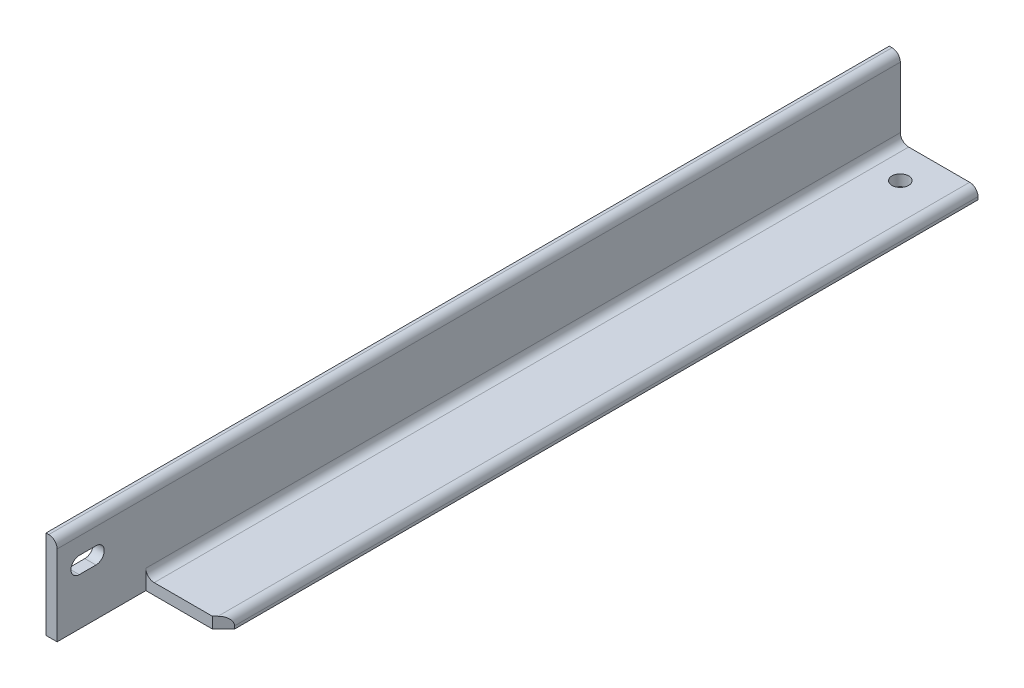
ISO-10303-21;
HEADER;
FILE_DESCRIPTION(('STEP AP214'),'2;1');
FILE_NAME('part.step','',(''),(''),'','','');
FILE_SCHEMA(('AUTOMOTIVE_DESIGN { 1 0 10303 214 1 1 1 1 }'));
ENDSEC;
DATA;
#1=APPLICATION_CONTEXT('core data for automotive mechanical design processes');
#2=APPLICATION_PROTOCOL_DEFINITION('international standard','automotive_design',2000,#1);
#3=PRODUCT_CONTEXT('',#1,'mechanical');
#4=PRODUCT('Part','Part','',(#3));
#5=PRODUCT_RELATED_PRODUCT_CATEGORY('part','',(#4));
#6=PRODUCT_DEFINITION_FORMATION('','',#4);
#7=PRODUCT_DEFINITION_CONTEXT('part definition',#1,'design');
#8=PRODUCT_DEFINITION('design','',#6,#7);
#9=PRODUCT_DEFINITION_SHAPE('','',#8);
#10=(LENGTH_UNIT() NAMED_UNIT(*) SI_UNIT(.MILLI.,.METRE.));
#11=(NAMED_UNIT(*) PLANE_ANGLE_UNIT() SI_UNIT($,.RADIAN.));
#12=(NAMED_UNIT(*) SI_UNIT($,.STERADIAN.) SOLID_ANGLE_UNIT());
#13=UNCERTAINTY_MEASURE_WITH_UNIT(LENGTH_MEASURE(1.E-05),#10,'distance_accuracy_value','');
#14=(GEOMETRIC_REPRESENTATION_CONTEXT(3) GLOBAL_UNCERTAINTY_ASSIGNED_CONTEXT((#13)) GLOBAL_UNIT_ASSIGNED_CONTEXT((#10,
#11,#12)) REPRESENTATION_CONTEXT('',''));
#15=CARTESIAN_POINT('',(0.,0.,0.));
#16=DIRECTION('',(0.,0.,1.));
#17=DIRECTION('',(1.,0.,0.));
#18=AXIS2_PLACEMENT_3D('',#15,#16,#17);
#19=CARTESIAN_POINT('',(101.6,0.,482.6));
#20=DIRECTION('',(0.,1.,0.));
#21=DIRECTION('',(-1.,0.,0.));
#22=AXIS2_PLACEMENT_3D('',#19,#20,#21);
#23=PLANE('',#22);
#24=CARTESIAN_POINT('',(50.8,0.,-444.5));
#25=DIRECTION('',(0.,-1.,0.));
#26=DIRECTION('',(0.,0.,-1.));
#27=AXIS2_PLACEMENT_3D('',#24,#25,#26);
#28=CIRCLE('',#27,9.525);
#29=CARTESIAN_POINT('',(50.8,0.,-454.025));
#30=VERTEX_POINT('',#29);
#31=EDGE_CURVE('E305',#30,#30,#28,.T.);
#32=ORIENTED_EDGE('',*,*,#31,.F.);
#33=EDGE_LOOP('',(#32));
#34=FACE_BOUND('',#33,.T.);
#35=DIRECTION('',(0.,0.,-1.));
#36=VECTOR('',#35,1.);
#37=CARTESIAN_POINT('',(101.6,0.,482.6));
#38=LINE('',#37,#36);
#39=CARTESIAN_POINT('',(101.6,0.,368.3));
#40=VERTEX_POINT('',#39);
#41=CARTESIAN_POINT('',(101.6,0.,-482.6));
#42=VERTEX_POINT('',#41);
#43=EDGE_CURVE('E11',#40,#42,#38,.T.);
#44=ORIENTED_EDGE('',*,*,#43,.F.);
#45=DIRECTION('',(0.707106781186548,0.,-0.707106781186548));
#46=VECTOR('',#45,1.);
#47=CARTESIAN_POINT('',(88.9,0.,381.));
#48=LINE('',#47,#46);
#49=CARTESIAN_POINT('',(88.9,0.,381.));
#50=VERTEX_POINT('',#49);
#51=EDGE_CURVE('E173',#50,#40,#48,.T.);
#52=ORIENTED_EDGE('',*,*,#51,.F.);
#53=DIRECTION('',(1.,0.,0.));
#54=VECTOR('',#53,1.);
#55=CARTESIAN_POINT('',(88.9,0.,381.));
#56=LINE('',#55,#54);
#57=CARTESIAN_POINT('',(12.7,0.,381.));
#58=VERTEX_POINT('',#57);
#59=EDGE_CURVE('E170',#58,#50,#56,.T.);
#60=ORIENTED_EDGE('',*,*,#59,.F.);
#61=DIRECTION('',(0.,0.,-1.));
#62=VECTOR('',#61,1.);
#63=CARTESIAN_POINT('',(12.7,0.,381.));
#64=LINE('',#63,#62);
#65=CARTESIAN_POINT('',(12.7,0.,482.6));
#66=VERTEX_POINT('',#65);
#67=EDGE_CURVE('E167',#66,#58,#64,.T.);
#68=ORIENTED_EDGE('',*,*,#67,.F.);
#69=DIRECTION('',(1.,0.,0.));
#70=VECTOR('',#69,1.);
#71=CARTESIAN_POINT('',(101.6,0.,482.6));
#72=LINE('',#71,#70);
#73=CARTESIAN_POINT('',(0.,0.,482.6));
#74=VERTEX_POINT('',#73);
#75=EDGE_CURVE('E183',#74,#66,#72,.T.);
#76=ORIENTED_EDGE('',*,*,#75,.F.);
#77=DIRECTION('',(0.,0.,-1.));
#78=VECTOR('',#77,1.);
#79=CARTESIAN_POINT('',(0.,0.,482.6));
#80=LINE('',#79,#78);
#81=CARTESIAN_POINT('',(0.,0.,-482.6));
#82=VERTEX_POINT('',#81);
#83=EDGE_CURVE('E195',#74,#82,#80,.T.);
#84=ORIENTED_EDGE('',*,*,#83,.T.);
#85=DIRECTION('',(1.,0.,0.));
#86=VECTOR('',#85,1.);
#87=CARTESIAN_POINT('',(101.6,0.,-482.6));
#88=LINE('',#87,#86);
#89=EDGE_CURVE('E179',#82,#42,#88,.T.);
#90=ORIENTED_EDGE('',*,*,#89,.T.);
#91=EDGE_LOOP('',(#44,#52,#60,#68,#76,#84,#90));
#92=FACE_BOUND('',#91,.T.);
#93=ADVANCED_FACE('F17',(#34,#92),#23,.F.);
#94=CARTESIAN_POINT('',(101.6,3.18008,482.6));
#95=DIRECTION('',(-1.,0.,0.));
#96=DIRECTION('',(0.,0.,1.));
#97=AXIS2_PLACEMENT_3D('',#94,#95,#96);
#98=PLANE('',#97);
#99=DIRECTION('',(0.,0.,-1.));
#100=VECTOR('',#99,1.);
#101=CARTESIAN_POINT('',(101.6,3.18008,482.6));
#102=LINE('',#101,#100);
#103=CARTESIAN_POINT('',(101.6,3.18008,368.3));
#104=VERTEX_POINT('',#103);
#105=CARTESIAN_POINT('',(101.6,3.18008,-482.6));
#106=VERTEX_POINT('',#105);
#107=EDGE_CURVE('E25',#104,#106,#102,.T.);
#108=ORIENTED_EDGE('',*,*,#107,.F.);
#109=DIRECTION('',(0.,-1.,0.));
#110=VECTOR('',#109,1.);
#111=CARTESIAN_POINT('',(101.6,101.601,368.3));
#112=LINE('',#111,#110);
#113=EDGE_CURVE('E176',#104,#40,#112,.T.);
#114=ORIENTED_EDGE('',*,*,#113,.T.);
#115=ORIENTED_EDGE('',*,*,#43,.T.);
#116=DIRECTION('',(0.,1.,0.));
#117=VECTOR('',#116,1.);
#118=CARTESIAN_POINT('',(101.6,3.18008,-482.6));
#119=LINE('',#118,#117);
#120=EDGE_CURVE('E198',#42,#106,#119,.T.);
#121=ORIENTED_EDGE('',*,*,#120,.T.);
#122=EDGE_LOOP('',(#108,#114,#115,#121));
#123=FACE_BOUND('',#122,.T.);
#124=ADVANCED_FACE('F243',(#123),#98,.F.);
#125=CARTESIAN_POINT('',(92.08008,3.18008,482.6));
#126=DIRECTION('',(0.,0.,-1.));
#127=DIRECTION('',(-1.,0.,0.));
#128=AXIS2_PLACEMENT_3D('',#125,#126,#127);
#129=CYLINDRICAL_SURFACE('',#128,9.51992);
#130=DIRECTION('',(0.,0.,-1.));
#131=VECTOR('',#130,1.);
#132=CARTESIAN_POINT('',(92.08008,12.7,482.6));
#133=LINE('',#132,#131);
#134=CARTESIAN_POINT('',(92.08008,12.7,377.81992));
#135=VERTEX_POINT('',#134);
#136=CARTESIAN_POINT('',(92.08008,12.7,-482.6));
#137=VERTEX_POINT('',#136);
#138=EDGE_CURVE('E232',#135,#137,#133,.T.);
#139=ORIENTED_EDGE('',*,*,#138,.F.);
#140=CARTESIAN_POINT('',(92.08008,3.18008,377.81992));
#141=DIRECTION('',(-0.707106781186548,0.,-0.707106781186548));
#142=DIRECTION('',(0.707106781186548,0.,-0.707106781186548));
#143=AXIS2_PLACEMENT_3D('',#140,#141,#142);
#144=ELLIPSE('',#143,13.4631999767069,9.51992);
#145=EDGE_CURVE('E137',#104,#135,#144,.F.);
#146=ORIENTED_EDGE('',*,*,#145,.F.);
#147=ORIENTED_EDGE('',*,*,#107,.T.);
#148=CARTESIAN_POINT('',(92.08008,3.18008,-482.6));
#149=DIRECTION('',(0.,0.,1.));
#150=DIRECTION('',(1.,0.,0.));
#151=AXIS2_PLACEMENT_3D('',#148,#149,#150);
#152=CIRCLE('',#151,9.51992);
#153=EDGE_CURVE('E201',#106,#137,#152,.T.);
#154=ORIENTED_EDGE('',*,*,#153,.T.);
#155=EDGE_LOOP('',(#139,#146,#147,#154));
#156=FACE_BOUND('',#155,.T.);
#157=ADVANCED_FACE('F238',(#156),#129,.T.);
#158=CARTESIAN_POINT('',(22.225,12.7,482.6));
#159=DIRECTION('',(0.,-1.,0.));
#160=DIRECTION('',(1.,0.,0.));
#161=AXIS2_PLACEMENT_3D('',#158,#159,#160);
#162=PLANE('',#161);
#163=CARTESIAN_POINT('',(50.8,12.7,-444.5));
#164=DIRECTION('',(0.,-1.,0.));
#165=DIRECTION('',(1.,0.,0.));
#166=AXIS2_PLACEMENT_3D('',#163,#164,#165);
#167=CIRCLE('',#166,9.525);
#168=CARTESIAN_POINT('',(60.325,12.7,-444.5));
#169=VERTEX_POINT('',#168);
#170=EDGE_CURVE('E20',#169,#169,#167,.T.);
#171=ORIENTED_EDGE('',*,*,#170,.T.);
#172=EDGE_LOOP('',(#171));
#173=FACE_BOUND('',#172,.T.);
#174=DIRECTION('',(-1.,0.,0.));
#175=VECTOR('',#174,1.);
#176=CARTESIAN_POINT('',(88.9,12.7,381.));
#177=LINE('',#176,#175);
#178=CARTESIAN_POINT('',(88.9,12.7,381.));
#179=VERTEX_POINT('',#178);
#180=CARTESIAN_POINT('',(22.225,12.7,381.));
#181=VERTEX_POINT('',#180);
#182=EDGE_CURVE('E163',#179,#181,#177,.T.);
#183=ORIENTED_EDGE('',*,*,#182,.F.);
#184=DIRECTION('',(-0.707106781186548,0.,0.707106781186548));
#185=VECTOR('',#184,1.);
#186=CARTESIAN_POINT('',(88.9,12.7,381.));
#187=LINE('',#186,#185);
#188=EDGE_CURVE('E165',#135,#179,#187,.T.);
#189=ORIENTED_EDGE('',*,*,#188,.F.);
#190=ORIENTED_EDGE('',*,*,#138,.T.);
#191=DIRECTION('',(-1.,0.,0.));
#192=VECTOR('',#191,1.);
#193=CARTESIAN_POINT('',(22.225,12.7,-482.6));
#194=LINE('',#193,#192);
#195=CARTESIAN_POINT('',(22.225,12.7,-482.6));
#196=VERTEX_POINT('',#195);
#197=EDGE_CURVE('E204',#137,#196,#194,.T.);
#198=ORIENTED_EDGE('',*,*,#197,.T.);
#199=DIRECTION('',(0.,0.,-1.));
#200=VECTOR('',#199,1.);
#201=CARTESIAN_POINT('',(22.225,12.7,482.6));
#202=LINE('',#201,#200);
#203=EDGE_CURVE('E230',#181,#196,#202,.T.);
#204=ORIENTED_EDGE('',*,*,#203,.F.);
#205=EDGE_LOOP('',(#183,#189,#190,#198,#204));
#206=FACE_BOUND('',#205,.T.);
#207=ADVANCED_FACE('F253',(#173,#206),#162,.F.);
#208=CARTESIAN_POINT('',(22.225,22.225,482.6));
#209=DIRECTION('',(0.,0.,-1.));
#210=DIRECTION('',(-1.,0.,0.));
#211=AXIS2_PLACEMENT_3D('',#208,#209,#210);
#212=CYLINDRICAL_SURFACE('',#211,9.525);
#213=DIRECTION('',(0.,0.,-1.));
#214=VECTOR('',#213,1.);
#215=CARTESIAN_POINT('',(12.7,22.225,482.6));
#216=LINE('',#215,#214);
#217=CARTESIAN_POINT('',(12.7,22.225,381.));
#218=VERTEX_POINT('',#217);
#219=CARTESIAN_POINT('',(12.7,22.225,-482.6));
#220=VERTEX_POINT('',#219);
#221=EDGE_CURVE('E228',#218,#220,#216,.T.);
#222=ORIENTED_EDGE('',*,*,#221,.F.);
#223=CARTESIAN_POINT('',(22.225,22.225,381.));
#224=DIRECTION('',(0.,0.,-1.));
#225=DIRECTION('',(-1.,0.,0.));
#226=AXIS2_PLACEMENT_3D('',#223,#224,#225);
#227=CIRCLE('',#226,9.525);
#228=EDGE_CURVE('E161',#181,#218,#227,.T.);
#229=ORIENTED_EDGE('',*,*,#228,.F.);
#230=ORIENTED_EDGE('',*,*,#203,.T.);
#231=CARTESIAN_POINT('',(22.225,22.225,-482.6));
#232=DIRECTION('',(0.,0.,-1.));
#233=DIRECTION('',(-1.,0.,0.));
#234=AXIS2_PLACEMENT_3D('',#231,#232,#233);
#235=CIRCLE('',#234,9.525);
#236=EDGE_CURVE('E207',#196,#220,#235,.T.);
#237=ORIENTED_EDGE('',*,*,#236,.T.);
#238=EDGE_LOOP('',(#222,#229,#230,#237));
#239=FACE_BOUND('',#238,.T.);
#240=ADVANCED_FACE('F285',(#239),#212,.F.);
#241=CARTESIAN_POINT('',(12.7,92.08008,482.6));
#242=DIRECTION('',(-1.,0.,0.));
#243=DIRECTION('',(0.,-1.,0.));
#244=AXIS2_PLACEMENT_3D('',#241,#242,#243);
#245=PLANE('',#244);
#246=DIRECTION('',(0.,0.,-1.));
#247=VECTOR('',#246,1.);
#248=CARTESIAN_POINT('',(12.7,53.975,457.2));
#249=LINE('',#248,#247);
#250=CARTESIAN_POINT('',(12.7,53.975,457.2));
#251=VERTEX_POINT('',#250);
#252=CARTESIAN_POINT('',(12.7,53.975,438.15));
#253=VERTEX_POINT('',#252);
#254=EDGE_CURVE('E143',#251,#253,#249,.T.);
#255=ORIENTED_EDGE('',*,*,#254,.F.);
#256=CARTESIAN_POINT('',(12.7,63.5,457.2));
#257=DIRECTION('',(-1.,0.,0.));
#258=DIRECTION('',(0.,-1.,0.));
#259=AXIS2_PLACEMENT_3D('',#256,#257,#258);
#260=CIRCLE('',#259,9.525);
#261=CARTESIAN_POINT('',(12.7,73.025,457.2));
#262=VERTEX_POINT('',#261);
#263=EDGE_CURVE('E125',#262,#251,#260,.F.);
#264=ORIENTED_EDGE('',*,*,#263,.F.);
#265=DIRECTION('',(0.,0.,1.));
#266=VECTOR('',#265,1.);
#267=CARTESIAN_POINT('',(12.7,73.025,457.2));
#268=LINE('',#267,#266);
#269=CARTESIAN_POINT('',(12.7,73.025,438.15));
#270=VERTEX_POINT('',#269);
#271=EDGE_CURVE('E134',#270,#262,#268,.T.);
#272=ORIENTED_EDGE('',*,*,#271,.F.);
#273=CARTESIAN_POINT('',(12.7,63.5,438.15));
#274=DIRECTION('',(-1.,0.,0.));
#275=DIRECTION('',(0.,-1.,0.));
#276=AXIS2_PLACEMENT_3D('',#273,#274,#275);
#277=CIRCLE('',#276,9.525);
#278=EDGE_CURVE('E32',#253,#270,#277,.F.);
#279=ORIENTED_EDGE('',*,*,#278,.F.);
#280=EDGE_LOOP('',(#255,#264,#272,#279));
#281=FACE_BOUND('',#280,.T.);
#282=DIRECTION('',(0.,1.,0.));
#283=VECTOR('',#282,1.);
#284=CARTESIAN_POINT('',(12.7,92.08008,-482.6));
#285=LINE('',#284,#283);
#286=CARTESIAN_POINT('',(12.7,92.08008,-482.6));
#287=VERTEX_POINT('',#286);
#288=EDGE_CURVE('E210',#220,#287,#285,.T.);
#289=ORIENTED_EDGE('',*,*,#288,.T.);
#290=DIRECTION('',(0.,0.,-1.));
#291=VECTOR('',#290,1.);
#292=CARTESIAN_POINT('',(12.7,92.08008,482.6));
#293=LINE('',#292,#291);
#294=CARTESIAN_POINT('',(12.7,92.08008,482.6));
#295=VERTEX_POINT('',#294);
#296=EDGE_CURVE('E225',#295,#287,#293,.T.);
#297=ORIENTED_EDGE('',*,*,#296,.F.);
#298=DIRECTION('',(0.,1.,0.));
#299=VECTOR('',#298,1.);
#300=CARTESIAN_POINT('',(12.7,92.08008,482.6));
#301=LINE('',#300,#299);
#302=EDGE_CURVE('E186',#66,#295,#301,.T.);
#303=ORIENTED_EDGE('',*,*,#302,.F.);
#304=ORIENTED_EDGE('',*,*,#67,.T.);
#305=DIRECTION('',(0.,-1.,0.));
#306=VECTOR('',#305,1.);
#307=CARTESIAN_POINT('',(12.7,101.601,381.));
#308=LINE('',#307,#306);
#309=EDGE_CURVE('E175',#218,#58,#308,.T.);
#310=ORIENTED_EDGE('',*,*,#309,.F.);
#311=ORIENTED_EDGE('',*,*,#221,.T.);
#312=EDGE_LOOP('',(#289,#297,#303,#304,#310,#311));
#313=FACE_BOUND('',#312,.T.);
#314=ADVANCED_FACE('F140',(#281,#313),#245,.F.);
#315=CARTESIAN_POINT('',(3.18008,92.08008,482.6));
#316=DIRECTION('',(0.,0.,-1.));
#317=DIRECTION('',(-1.,0.,0.));
#318=AXIS2_PLACEMENT_3D('',#315,#316,#317);
#319=CYLINDRICAL_SURFACE('',#318,9.51992);
#320=CARTESIAN_POINT('',(3.18008,92.08008,-482.6));
#321=DIRECTION('',(0.,0.,1.));
#322=DIRECTION('',(-1.,0.,0.));
#323=AXIS2_PLACEMENT_3D('',#320,#321,#322);
#324=CIRCLE('',#323,9.51992);
#325=CARTESIAN_POINT('',(3.18008,101.6,-482.6));
#326=VERTEX_POINT('',#325);
#327=EDGE_CURVE('E212',#287,#326,#324,.T.);
#328=ORIENTED_EDGE('',*,*,#327,.T.);
#329=DIRECTION('',(0.,0.,-1.));
#330=VECTOR('',#329,1.);
#331=CARTESIAN_POINT('',(3.18008,101.6,482.6));
#332=LINE('',#331,#330);
#333=CARTESIAN_POINT('',(3.18008,101.6,482.6));
#334=VERTEX_POINT('',#333);
#335=EDGE_CURVE('E222',#334,#326,#332,.T.);
#336=ORIENTED_EDGE('',*,*,#335,.F.);
#337=CARTESIAN_POINT('',(3.18008,92.08008,482.6));
#338=DIRECTION('',(0.,0.,1.));
#339=DIRECTION('',(-1.,0.,0.));
#340=AXIS2_PLACEMENT_3D('',#337,#338,#339);
#341=CIRCLE('',#340,9.51992);
#342=EDGE_CURVE('E189',#295,#334,#341,.T.);
#343=ORIENTED_EDGE('',*,*,#342,.F.);
#344=ORIENTED_EDGE('',*,*,#296,.T.);
#345=EDGE_LOOP('',(#328,#336,#343,#344));
#346=FACE_BOUND('',#345,.T.);
#347=ADVANCED_FACE('F281',(#346),#319,.T.);
#348=CARTESIAN_POINT('',(0.,101.6,482.6));
#349=DIRECTION('',(0.,-1.,0.));
#350=DIRECTION('',(0.,0.,-1.));
#351=AXIS2_PLACEMENT_3D('',#348,#349,#350);
#352=PLANE('',#351);
#353=DIRECTION('',(-1.,0.,0.));
#354=VECTOR('',#353,1.);
#355=CARTESIAN_POINT('',(0.,101.6,-482.6));
#356=LINE('',#355,#354);
#357=CARTESIAN_POINT('',(0.,101.6,-482.6));
#358=VERTEX_POINT('',#357);
#359=EDGE_CURVE('E214',#326,#358,#356,.T.);
#360=ORIENTED_EDGE('',*,*,#359,.T.);
#361=DIRECTION('',(0.,0.,-1.));
#362=VECTOR('',#361,1.);
#363=CARTESIAN_POINT('',(0.,101.6,482.6));
#364=LINE('',#363,#362);
#365=CARTESIAN_POINT('',(0.,101.6,482.6));
#366=VERTEX_POINT('',#365);
#367=EDGE_CURVE('E219',#366,#358,#364,.T.);
#368=ORIENTED_EDGE('',*,*,#367,.F.);
#369=DIRECTION('',(-1.,0.,0.));
#370=VECTOR('',#369,1.);
#371=CARTESIAN_POINT('',(0.,101.6,482.6));
#372=LINE('',#371,#370);
#373=EDGE_CURVE('E191',#334,#366,#372,.T.);
#374=ORIENTED_EDGE('',*,*,#373,.F.);
#375=ORIENTED_EDGE('',*,*,#335,.T.);
#376=EDGE_LOOP('',(#360,#368,#374,#375));
#377=FACE_BOUND('',#376,.T.);
#378=ADVANCED_FACE('F277',(#377),#352,.F.);
#379=CARTESIAN_POINT('',(0.,0.,482.6));
#380=DIRECTION('',(1.,0.,0.));
#381=DIRECTION('',(0.,0.,-1.));
#382=AXIS2_PLACEMENT_3D('',#379,#380,#381);
#383=PLANE('',#382);
#384=DIRECTION('',(0.,0.,-1.));
#385=VECTOR('',#384,1.);
#386=CARTESIAN_POINT('',(0.,73.025,457.2));
#387=LINE('',#386,#385);
#388=CARTESIAN_POINT('',(0.,73.025,457.2));
#389=VERTEX_POINT('',#388);
#390=CARTESIAN_POINT('',(0.,73.025,438.15));
#391=VERTEX_POINT('',#390);
#392=EDGE_CURVE('E145',#389,#391,#387,.T.);
#393=ORIENTED_EDGE('',*,*,#392,.F.);
#394=CARTESIAN_POINT('',(0.,63.5,457.2));
#395=DIRECTION('',(-1.,0.,0.));
#396=DIRECTION('',(0.,0.,1.));
#397=AXIS2_PLACEMENT_3D('',#394,#395,#396);
#398=CIRCLE('',#397,9.525);
#399=CARTESIAN_POINT('',(0.,53.975,457.2));
#400=VERTEX_POINT('',#399);
#401=EDGE_CURVE('E40',#400,#389,#398,.T.);
#402=ORIENTED_EDGE('',*,*,#401,.F.);
#403=DIRECTION('',(0.,0.,1.));
#404=VECTOR('',#403,1.);
#405=CARTESIAN_POINT('',(0.,53.975,457.2));
#406=LINE('',#405,#404);
#407=CARTESIAN_POINT('',(0.,53.975,438.15));
#408=VERTEX_POINT('',#407);
#409=EDGE_CURVE('E131',#408,#400,#406,.T.);
#410=ORIENTED_EDGE('',*,*,#409,.F.);
#411=CARTESIAN_POINT('',(0.,63.5,438.15));
#412=DIRECTION('',(-1.,0.,0.));
#413=DIRECTION('',(0.,0.,1.));
#414=AXIS2_PLACEMENT_3D('',#411,#412,#413);
#415=CIRCLE('',#414,9.525);
#416=EDGE_CURVE('E151',#391,#408,#415,.T.);
#417=ORIENTED_EDGE('',*,*,#416,.F.);
#418=EDGE_LOOP('',(#393,#402,#410,#417));
#419=FACE_BOUND('',#418,.T.);
#420=DIRECTION('',(0.,-1.,0.));
#421=VECTOR('',#420,1.);
#422=CARTESIAN_POINT('',(0.,0.,-482.6));
#423=LINE('',#422,#421);
#424=EDGE_CURVE('E187',#358,#82,#423,.T.);
#425=ORIENTED_EDGE('',*,*,#424,.T.);
#426=ORIENTED_EDGE('',*,*,#83,.F.);
#427=DIRECTION('',(0.,-1.,0.));
#428=VECTOR('',#427,1.);
#429=CARTESIAN_POINT('',(0.,0.,482.6));
#430=LINE('',#429,#428);
#431=EDGE_CURVE('E193',#366,#74,#430,.T.);
#432=ORIENTED_EDGE('',*,*,#431,.F.);
#433=ORIENTED_EDGE('',*,*,#367,.T.);
#434=EDGE_LOOP('',(#425,#426,#432,#433));
#435=FACE_BOUND('',#434,.T.);
#436=ADVANCED_FACE('F272',(#419,#435),#383,.F.);
#437=CARTESIAN_POINT('',(3.18008,92.08008,482.6));
#438=DIRECTION('',(0.,0.,-1.));
#439=DIRECTION('',(-1.,0.,0.));
#440=AXIS2_PLACEMENT_3D('',#437,#438,#439);
#441=PLANE('',#440);
#442=ORIENTED_EDGE('',*,*,#75,.T.);
#443=ORIENTED_EDGE('',*,*,#302,.T.);
#444=ORIENTED_EDGE('',*,*,#342,.T.);
#445=ORIENTED_EDGE('',*,*,#373,.T.);
#446=ORIENTED_EDGE('',*,*,#431,.T.);
#447=EDGE_LOOP('',(#442,#443,#444,#445,#446));
#448=FACE_BOUND('',#447,.T.);
#449=ADVANCED_FACE('F333',(#448),#441,.F.);
#450=CARTESIAN_POINT('',(3.18008,92.08008,-482.6));
#451=DIRECTION('',(0.,0.,-1.));
#452=DIRECTION('',(-1.,0.,0.));
#453=AXIS2_PLACEMENT_3D('',#450,#451,#452);
#454=PLANE('',#453);
#455=ORIENTED_EDGE('',*,*,#89,.F.);
#456=ORIENTED_EDGE('',*,*,#424,.F.);
#457=ORIENTED_EDGE('',*,*,#359,.F.);
#458=ORIENTED_EDGE('',*,*,#327,.F.);
#459=ORIENTED_EDGE('',*,*,#288,.F.);
#460=ORIENTED_EDGE('',*,*,#236,.F.);
#461=ORIENTED_EDGE('',*,*,#197,.F.);
#462=ORIENTED_EDGE('',*,*,#153,.F.);
#463=ORIENTED_EDGE('',*,*,#120,.F.);
#464=EDGE_LOOP('',(#455,#456,#457,#458,#459,#460,#461,#462,#463));
#465=FACE_BOUND('',#464,.T.);
#466=ADVANCED_FACE('F247',(#465),#454,.T.);
#467=CARTESIAN_POINT('',(88.9,101.601,381.));
#468=DIRECTION('',(-0.707106781186548,0.,-0.707106781186548));
#469=DIRECTION('',(-0.707106781186548,0.,0.707106781186548));
#470=AXIS2_PLACEMENT_3D('',#467,#468,#469);
#471=PLANE('',#470);
#472=ORIENTED_EDGE('',*,*,#145,.T.);
#473=ORIENTED_EDGE('',*,*,#188,.T.);
#474=DIRECTION('',(0.,-1.,0.));
#475=VECTOR('',#474,1.);
#476=CARTESIAN_POINT('',(88.9,101.601,381.));
#477=LINE('',#476,#475);
#478=EDGE_CURVE('E180',#179,#50,#477,.T.);
#479=ORIENTED_EDGE('',*,*,#478,.T.);
#480=ORIENTED_EDGE('',*,*,#51,.T.);
#481=ORIENTED_EDGE('',*,*,#113,.F.);
#482=EDGE_LOOP('',(#472,#473,#479,#480,#481));
#483=FACE_BOUND('',#482,.T.);
#484=ADVANCED_FACE('F257',(#483),#471,.F.);
#485=CARTESIAN_POINT('',(88.9,101.601,381.));
#486=DIRECTION('',(0.,0.,-1.));
#487=DIRECTION('',(-1.,0.,0.));
#488=AXIS2_PLACEMENT_3D('',#485,#486,#487);
#489=PLANE('',#488);
#490=ORIENTED_EDGE('',*,*,#182,.T.);
#491=ORIENTED_EDGE('',*,*,#228,.T.);
#492=ORIENTED_EDGE('',*,*,#309,.T.);
#493=ORIENTED_EDGE('',*,*,#59,.T.);
#494=ORIENTED_EDGE('',*,*,#478,.F.);
#495=EDGE_LOOP('',(#490,#491,#492,#493,#494));
#496=FACE_BOUND('',#495,.T.);
#497=ADVANCED_FACE('F259',(#496),#489,.F.);
#498=CARTESIAN_POINT('',(101.601,63.5,457.2));
#499=DIRECTION('',(-1.,0.,0.));
#500=DIRECTION('',(0.,0.,1.));
#501=AXIS2_PLACEMENT_3D('',#498,#499,#500);
#502=CYLINDRICAL_SURFACE('',#501,9.525);
#503=ORIENTED_EDGE('',*,*,#263,.T.);
#504=DIRECTION('',(-1.,0.,0.));
#505=VECTOR('',#504,1.);
#506=CARTESIAN_POINT('',(101.601,53.975,457.2));
#507=LINE('',#506,#505);
#508=EDGE_CURVE('E138',#251,#400,#507,.T.);
#509=ORIENTED_EDGE('',*,*,#508,.T.);
#510=ORIENTED_EDGE('',*,*,#401,.T.);
#511=DIRECTION('',(-1.,0.,0.));
#512=VECTOR('',#511,1.);
#513=CARTESIAN_POINT('',(101.601,73.025,457.2));
#514=LINE('',#513,#512);
#515=EDGE_CURVE('E121',#262,#389,#514,.T.);
#516=ORIENTED_EDGE('',*,*,#515,.F.);
#517=EDGE_LOOP('',(#503,#509,#510,#516));
#518=FACE_BOUND('',#517,.T.);
#519=ADVANCED_FACE('F123',(#518),#502,.F.);
#520=CARTESIAN_POINT('',(101.601,53.975,457.2));
#521=DIRECTION('',(0.,-1.,0.));
#522=DIRECTION('',(0.,0.,-1.));
#523=AXIS2_PLACEMENT_3D('',#520,#521,#522);
#524=PLANE('',#523);
#525=ORIENTED_EDGE('',*,*,#254,.T.);
#526=DIRECTION('',(-1.,0.,0.));
#527=VECTOR('',#526,1.);
#528=CARTESIAN_POINT('',(101.601,53.975,438.15));
#529=LINE('',#528,#527);
#530=EDGE_CURVE('E157',#253,#408,#529,.T.);
#531=ORIENTED_EDGE('',*,*,#530,.T.);
#532=ORIENTED_EDGE('',*,*,#409,.T.);
#533=ORIENTED_EDGE('',*,*,#508,.F.);
#534=EDGE_LOOP('',(#525,#531,#532,#533));
#535=FACE_BOUND('',#534,.T.);
#536=ADVANCED_FACE('F321',(#535),#524,.F.);
#537=CARTESIAN_POINT('',(101.601,63.5,438.15));
#538=DIRECTION('',(-1.,0.,0.));
#539=DIRECTION('',(0.,0.,1.));
#540=AXIS2_PLACEMENT_3D('',#537,#538,#539);
#541=CYLINDRICAL_SURFACE('',#540,9.525);
#542=ORIENTED_EDGE('',*,*,#278,.T.);
#543=DIRECTION('',(-1.,0.,0.));
#544=VECTOR('',#543,1.);
#545=CARTESIAN_POINT('',(101.601,73.025,438.15));
#546=LINE('',#545,#544);
#547=EDGE_CURVE('E130',#270,#391,#546,.T.);
#548=ORIENTED_EDGE('',*,*,#547,.T.);
#549=ORIENTED_EDGE('',*,*,#416,.T.);
#550=ORIENTED_EDGE('',*,*,#530,.F.);
#551=EDGE_LOOP('',(#542,#548,#549,#550));
#552=FACE_BOUND('',#551,.T.);
#553=ADVANCED_FACE('F318',(#552),#541,.F.);
#554=CARTESIAN_POINT('',(101.601,73.025,457.2));
#555=DIRECTION('',(0.,1.,0.));
#556=DIRECTION('',(0.,0.,1.));
#557=AXIS2_PLACEMENT_3D('',#554,#555,#556);
#558=PLANE('',#557);
#559=ORIENTED_EDGE('',*,*,#271,.T.);
#560=ORIENTED_EDGE('',*,*,#515,.T.);
#561=ORIENTED_EDGE('',*,*,#392,.T.);
#562=ORIENTED_EDGE('',*,*,#547,.F.);
#563=EDGE_LOOP('',(#559,#560,#561,#562));
#564=FACE_BOUND('',#563,.T.);
#565=ADVANCED_FACE('F135',(#564),#558,.F.);
#566=CARTESIAN_POINT('',(50.8,0.,-444.5));
#567=DIRECTION('',(0.,-1.,0.));
#568=DIRECTION('',(0.,0.,-1.));
#569=AXIS2_PLACEMENT_3D('',#566,#567,#568);
#570=CYLINDRICAL_SURFACE('',#569,9.525);
#571=ORIENTED_EDGE('',*,*,#31,.T.);
#572=EDGE_LOOP('',(#571));
#573=FACE_BOUND('',#572,.T.);
#574=ORIENTED_EDGE('',*,*,#170,.F.);
#575=EDGE_LOOP('',(#574));
#576=FACE_BOUND('',#575,.T.);
#577=ADVANCED_FACE('F311',(#573,#576),#570,.F.);
#578=CLOSED_SHELL('',(#93,#124,#157,#207,#240,#314,#347,#378,#436,#449,#466,#484,#497,#519,#536,
#553,#565,#577));
#579=MANIFOLD_SOLID_BREP('B1',#578);
#580=ADVANCED_BREP_SHAPE_REPRESENTATION('',(#18,#579),#14);
#581=SHAPE_DEFINITION_REPRESENTATION(#9,#580);
ENDSEC;
END-ISO-10303-21;
